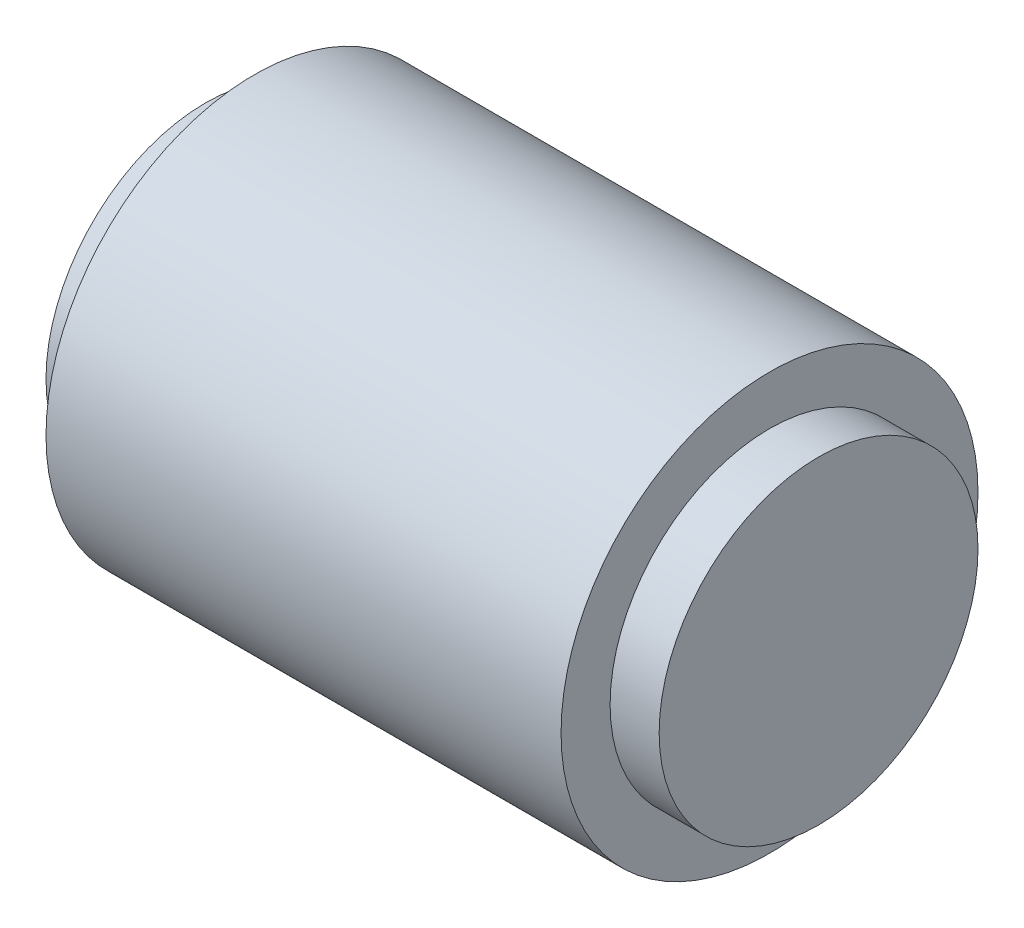
ISO-10303-21;
HEADER;
FILE_DESCRIPTION(('STEP AP214'),'2;1');
FILE_NAME('part.step','',(''),(''),'','','');
FILE_SCHEMA(('AUTOMOTIVE_DESIGN { 1 0 10303 214 1 1 1 1 }'));
ENDSEC;
DATA;
#1=APPLICATION_CONTEXT('core data for automotive mechanical design processes');
#2=APPLICATION_PROTOCOL_DEFINITION('international standard','automotive_design',2000,#1);
#3=PRODUCT_CONTEXT('',#1,'mechanical');
#4=PRODUCT('Part','Part','',(#3));
#5=PRODUCT_RELATED_PRODUCT_CATEGORY('part','',(#4));
#6=PRODUCT_DEFINITION_FORMATION('','',#4);
#7=PRODUCT_DEFINITION_CONTEXT('part definition',#1,'design');
#8=PRODUCT_DEFINITION('design','',#6,#7);
#9=PRODUCT_DEFINITION_SHAPE('','',#8);
#10=(LENGTH_UNIT() NAMED_UNIT(*) SI_UNIT(.MILLI.,.METRE.));
#11=(NAMED_UNIT(*) PLANE_ANGLE_UNIT() SI_UNIT($,.RADIAN.));
#12=(NAMED_UNIT(*) SI_UNIT($,.STERADIAN.) SOLID_ANGLE_UNIT());
#13=UNCERTAINTY_MEASURE_WITH_UNIT(LENGTH_MEASURE(1.E-05),#10,'distance_accuracy_value','');
#14=(GEOMETRIC_REPRESENTATION_CONTEXT(3) GLOBAL_UNCERTAINTY_ASSIGNED_CONTEXT((#13)) GLOBAL_UNIT_ASSIGNED_CONTEXT((#10,
#11,#12)) REPRESENTATION_CONTEXT('',''));
#15=CARTESIAN_POINT('',(0.,0.,0.));
#16=DIRECTION('',(0.,0.,1.));
#17=DIRECTION('',(1.,0.,0.));
#18=AXIS2_PLACEMENT_3D('',#15,#16,#17);
#19=CARTESIAN_POINT('',(-25.,-6.5,0.));
#20=DIRECTION('',(1.,0.,0.));
#21=DIRECTION('',(0.,0.,-1.));
#22=AXIS2_PLACEMENT_3D('',#19,#20,#21);
#23=PLANE('',#22);
#24=CARTESIAN_POINT('',(-25.,0.,0.));
#25=DIRECTION('',(1.,0.,0.));
#26=DIRECTION('',(0.,0.,-1.));
#27=AXIS2_PLACEMENT_3D('',#24,#25,#26);
#28=CIRCLE('',#27,6.5);
#29=CARTESIAN_POINT('',(-25.,0.,-6.5));
#30=VERTEX_POINT('',#29);
#31=EDGE_CURVE('E51',#30,#30,#28,.T.);
#32=ORIENTED_EDGE('',*,*,#31,.F.);
#33=EDGE_LOOP('',(#32));
#34=FACE_BOUND('',#33,.T.);
#35=ADVANCED_FACE('F29',(#34),#23,.F.);
#36=CARTESIAN_POINT('',(0.,0.,0.));
#37=DIRECTION('',(-1.,0.,0.));
#38=DIRECTION('',(0.,0.,1.));
#39=AXIS2_PLACEMENT_3D('',#36,#37,#38);
#40=PLANE('',#39);
#41=CARTESIAN_POINT('',(0.,0.,0.));
#42=DIRECTION('',(1.,0.,0.));
#43=DIRECTION('',(0.,0.,-1.));
#44=AXIS2_PLACEMENT_3D('',#41,#42,#43);
#45=CIRCLE('',#44,6.5);
#46=CARTESIAN_POINT('',(0.,0.,-6.5));
#47=VERTEX_POINT('',#46);
#48=EDGE_CURVE('E10',#47,#47,#45,.T.);
#49=ORIENTED_EDGE('',*,*,#48,.T.);
#50=EDGE_LOOP('',(#49));
#51=FACE_BOUND('',#50,.T.);
#52=ADVANCED_FACE('F77',(#51),#40,.F.);
#53=CARTESIAN_POINT('',(35.0660184255884,0.,0.));
#54=DIRECTION('',(1.,0.,0.));
#55=DIRECTION('',(0.,0.,-1.));
#56=AXIS2_PLACEMENT_3D('',#53,#54,#55);
#57=CYLINDRICAL_SURFACE('',#56,6.5);
#58=ORIENTED_EDGE('',*,*,#48,.F.);
#59=EDGE_LOOP('',(#58));
#60=FACE_BOUND('',#59,.T.);
#61=CARTESIAN_POINT('',(-2.,0.,0.));
#62=DIRECTION('',(1.,0.,0.));
#63=DIRECTION('',(0.,0.,-1.));
#64=AXIS2_PLACEMENT_3D('',#61,#62,#63);
#65=CIRCLE('',#64,6.5);
#66=CARTESIAN_POINT('',(-2.,0.,-6.5));
#67=VERTEX_POINT('',#66);
#68=EDGE_CURVE('E35',#67,#67,#65,.T.);
#69=ORIENTED_EDGE('',*,*,#68,.T.);
#70=EDGE_LOOP('',(#69));
#71=FACE_BOUND('',#70,.T.);
#72=ADVANCED_FACE('F82',(#60,#71),#57,.T.);
#73=CARTESIAN_POINT('',(-2.,-8.5,0.));
#74=DIRECTION('',(-1.,0.,0.));
#75=DIRECTION('',(0.,0.,1.));
#76=AXIS2_PLACEMENT_3D('',#73,#74,#75);
#77=PLANE('',#76);
#78=ORIENTED_EDGE('',*,*,#68,.F.);
#79=EDGE_LOOP('',(#78));
#80=FACE_BOUND('',#79,.T.);
#81=CARTESIAN_POINT('',(-2.,0.,0.));
#82=DIRECTION('',(1.,0.,0.));
#83=DIRECTION('',(0.,0.,-1.));
#84=AXIS2_PLACEMENT_3D('',#81,#82,#83);
#85=CIRCLE('',#84,8.5);
#86=CARTESIAN_POINT('',(-2.,0.,-8.5));
#87=VERTEX_POINT('',#86);
#88=EDGE_CURVE('E39',#87,#87,#85,.T.);
#89=ORIENTED_EDGE('',*,*,#88,.T.);
#90=EDGE_LOOP('',(#89));
#91=FACE_BOUND('',#90,.T.);
#92=ADVANCED_FACE('F98',(#80,#91),#77,.F.);
#93=CARTESIAN_POINT('',(35.0660184255884,0.,0.));
#94=DIRECTION('',(1.,0.,0.));
#95=DIRECTION('',(0.,0.,-1.));
#96=AXIS2_PLACEMENT_3D('',#93,#94,#95);
#97=CYLINDRICAL_SURFACE('',#96,8.5);
#98=CARTESIAN_POINT('',(-12.5,-7.08237248385031,4.7));
#99=CARTESIAN_POINT('',(-12.6203652056581,-7.08237051905884,4.70000142729945));
#100=CARTESIAN_POINT('',(-12.7407147300836,-7.08545083349817,4.69537075402284));
#101=CARTESIAN_POINT('',(-12.9804405392915,-7.09763997691406,4.6769253935247));
#102=CARTESIAN_POINT('',(-13.0998165021281,-7.10675072428559,4.66310778375833));
#103=CARTESIAN_POINT('',(-13.3367423413059,-7.13065428121709,4.62647233079428));
#104=CARTESIAN_POINT('',(-13.4542899085217,-7.14545375102183,4.60364393710211));
#105=CARTESIAN_POINT('',(-13.6866095351931,-7.18016841379333,4.54930911593437));
#106=CARTESIAN_POINT('',(-13.8013803249174,-7.20008590043597,4.51779879713325));
#107=CARTESIAN_POINT('',(-14.1388944914645,-7.26619921357827,4.41127440349213));
#108=CARTESIAN_POINT('',(-14.3566103700019,-7.31895179813542,4.32398547473472));
#109=CARTESIAN_POINT('',(-14.7741004748103,-7.43580241848109,4.11978311383889));
#110=CARTESIAN_POINT('',(-14.9738708170479,-7.4999029014708,4.00286328937593));
#111=CARTESIAN_POINT('',(-15.372414171304,-7.64019073190916,3.72874640899572));
#112=CARTESIAN_POINT('',(-15.5689969484275,-7.71694379531933,3.56865354851087));
#113=CARTESIAN_POINT('',(-15.9343512794768,-7.86938156309791,3.21857429343691));
#114=CARTESIAN_POINT('',(-16.1031059784344,-7.94506559478632,3.02856991715199));
#115=CARTESIAN_POINT('',(-16.3391242662258,-8.05565115267153,2.71482706672974));
#116=CARTESIAN_POINT('',(-16.4175871043808,-8.09341717518475,2.60036072933467));
#117=CARTESIAN_POINT('',(-16.5644846726843,-8.16553327867828,2.36416645474233));
#118=CARTESIAN_POINT('',(-16.6329234867722,-8.19988474895569,2.24244150341633));
#119=CARTESIAN_POINT('',(-16.7590593729932,-8.26417842862639,1.99248750312117));
#120=CARTESIAN_POINT('',(-16.8167601780261,-8.294122169538,1.86426073420593));
#121=CARTESIAN_POINT('',(-16.9207380130007,-8.3487103609807,1.60216759540605));
#122=CARTESIAN_POINT('',(-16.9670165824873,-8.37335552562205,1.46830198840211));
#123=CARTESIAN_POINT('',(-17.0441150544945,-8.41474993392174,1.20744981846162));
#124=CARTESIAN_POINT('',(-17.0759056640061,-8.43198791326759,1.08082737855372));
#125=CARTESIAN_POINT('',(-17.1289143047256,-8.46087184040931,0.824766844936431));
#126=CARTESIAN_POINT('',(-17.150133638184,-8.47251847698309,0.695329100089084));
#127=CARTESIAN_POINT('',(-17.1816813293856,-8.48987435546401,0.434816652119595));
#128=CARTESIAN_POINT('',(-17.1920163055212,-8.4955872054676,0.303742992863567));
#129=CARTESIAN_POINT('',(-17.2016572701205,-8.50091547143297,0.0410710945756316));
#130=CARTESIAN_POINT('',(-17.200964145099,-8.50053137750915,-0.0905271014401542));
#131=CARTESIAN_POINT('',(-17.1892231522629,-8.49404471128307,-0.339095726672583));
#132=CARTESIAN_POINT('',(-17.1792819983652,-8.48855334416514,-0.456136387591878));
#133=CARTESIAN_POINT('',(-17.1507213597211,-8.47284290325187,-0.688869000889557));
#134=CARTESIAN_POINT('',(-17.1320991906107,-8.46262236709889,-0.804560524734044));
#135=CARTESIAN_POINT('',(-17.0863981199442,-8.43769398106224,-1.03372871833718));
#136=CARTESIAN_POINT('',(-17.0593220616304,-8.42298763989891,-1.14720611914441));
#137=CARTESIAN_POINT('',(-16.9970126947121,-8.38942441861402,-1.37128565126162));
#138=CARTESIAN_POINT('',(-16.9617762396006,-8.37056593763826,-1.48188665513892));
#139=CARTESIAN_POINT('',(-16.843532990608,-8.3079310758471,-1.81057955284725));
#140=CARTESIAN_POINT('',(-16.7484359683463,-8.25834503355037,-2.02336292477915));
#141=CARTESIAN_POINT('',(-16.5295724266934,-8.14791666749397,-2.43023978616624));
#142=CARTESIAN_POINT('',(-16.4057968231951,-8.08707077834442,-2.62432732597161));
#143=CARTESIAN_POINT('',(-16.1177384150641,-7.95173868927888,-3.01100968754378));
#144=CARTESIAN_POINT('',(-15.9505164581314,-7.87648876950413,-3.20115374062658));
#145=CARTESIAN_POINT('',(-15.5880721788849,-7.724573412885,-3.55213130903994));
#146=CARTESIAN_POINT('',(-15.392820632895,-7.64790657236262,-3.71293383044693));
#147=CARTESIAN_POINT('',(-14.9586090171485,-7.49400640421319,-4.01511119853954));
#148=CARTESIAN_POINT('',(-14.717302450268,-7.41733439981516,-4.15346688615357));
#149=CARTESIAN_POINT('',(-14.3371222927061,-7.31574124687166,-4.32833629963319));
#150=CARTESIAN_POINT('',(-14.2073342263191,-7.2841082527669,-4.38118855784614));
#151=CARTESIAN_POINT('',(-13.9424447003849,-7.22661561780152,-4.47538486325711));
#152=CARTESIAN_POINT('',(-13.807346932917,-7.20075204590165,-4.51673675108816));
#153=CARTESIAN_POINT('',(-13.5438771672071,-7.15780422222049,-4.58446495282761));
#154=CARTESIAN_POINT('',(-13.4158322628942,-7.14018298665204,-4.6117749578275));
#155=CARTESIAN_POINT('',(-13.1572396080735,-7.11164339143349,-4.65566508265739));
#156=CARTESIAN_POINT('',(-13.0266933676671,-7.1007211113006,-4.67225147865837));
#157=CARTESIAN_POINT('',(-12.7643615587469,-7.08609558182642,-4.69440385355912));
#158=CARTESIAN_POINT('',(-12.6325769889938,-7.08238694527754,-4.69997805650284));
#159=CARTESIAN_POINT('',(-12.3690143653643,-7.08235811253355,-4.70002180883153));
#160=CARTESIAN_POINT('',(-12.2372363124106,-7.08603708908178,-4.69449260156397));
#161=CARTESIAN_POINT('',(-11.9944473690131,-7.09951674664522,-4.67407551403972));
#162=CARTESIAN_POINT('',(-11.8832510880993,-7.1083301661064,-4.66069484316186));
#163=CARTESIAN_POINT('',(-11.6625685100581,-7.13086365346316,-4.62614312079132));
#164=CARTESIAN_POINT('',(-11.5530827419814,-7.14458520924081,-4.60496970690311));
#165=CARTESIAN_POINT('',(-11.228246063643,-7.19247174470709,-4.53011334851335));
#166=CARTESIAN_POINT('',(-11.0163866128301,-7.23336657702825,-4.46508306841364));
#167=CARTESIAN_POINT('',(-10.598080396117,-7.33034680931937,-4.30408223438218));
#168=CARTESIAN_POINT('',(-10.392227391165,-7.38699436655751,-4.20693493663956));
#169=CARTESIAN_POINT('',(-9.99847598339761,-7.50883106773685,-3.98540200888254));
#170=CARTESIAN_POINT('',(-9.81058646807662,-7.57402440229604,-3.86100299514427));
#171=CARTESIAN_POINT('',(-9.426542977742,-7.71812920360414,-3.56534406921645));
#172=CARTESIAN_POINT('',(-9.23390146666726,-7.79756319616587,-3.38976768850456));
#173=CARTESIAN_POINT('',(-8.87931739827047,-7.95260360908088,-3.0080636231188));
#174=CARTESIAN_POINT('',(-8.71739335303637,-8.02820770133119,-2.80191764795081));
#175=CARTESIAN_POINT('',(-8.49715002440686,-8.1350127782603,-2.46705211863367));
#176=CARTESIAN_POINT('',(-8.42606265961709,-8.17029620842058,-2.34785409487927));
#177=CARTESIAN_POINT('',(-8.29432218442582,-8.23677626473988,-2.10276079413955));
#178=CARTESIAN_POINT('',(-8.23366440832777,-8.2679747168242,-1.97686854500202));
#179=CARTESIAN_POINT('',(-8.12350793355991,-8.32535134968058,-1.71928216724073));
#180=CARTESIAN_POINT('',(-8.07400260478432,-8.35153251183072,-1.58759154170824));
#181=CARTESIAN_POINT('',(-7.986780611343,-8.39808231090582,-1.319366196905));
#182=CARTESIAN_POINT('',(-7.94906217482334,-8.41845182142196,-1.18283220914767));
#183=CARTESIAN_POINT('',(-7.88922318855488,-8.45095857442492,-0.920307023805964));
#184=CARTESIAN_POINT('',(-7.86590158939351,-8.46372486697502,-0.794666431384168));
#185=CARTESIAN_POINT('',(-7.82954402145036,-8.48368591996237,-0.54147264082718));
#186=CARTESIAN_POINT('',(-7.81650694066117,-8.49088128275153,-0.41391965098895));
#187=CARTESIAN_POINT('',(-7.80090984875112,-8.49949445489548,-0.158035154984153));
#188=CARTESIAN_POINT('',(-7.79834531716869,-8.50091475704617,-0.0297040086694109));
#189=CARTESIAN_POINT('',(-7.80371840878135,-8.49794421086991,0.226665398056366));
#190=CARTESIAN_POINT('',(-7.81165548994734,-8.49355366246355,0.354703673241946));
#191=CARTESIAN_POINT('',(-7.83671704313967,-8.47974699518894,0.597766955800252));
#192=CARTESIAN_POINT('',(-7.85293797696484,-8.47082552483959,0.712914180242321));
#193=CARTESIAN_POINT('',(-7.89375818143125,-8.44850164825868,0.941282914340208));
#194=CARTESIAN_POINT('',(-7.9183600595594,-8.43509784750433,1.05450381315169));
#195=CARTESIAN_POINT('',(-8.00435236234511,-8.3885909174889,1.39009216811059));
#196=CARTESIAN_POINT('',(-8.07795176987398,-8.34917948220641,1.60859649118793));
#197=CARTESIAN_POINT('',(-8.25778206451449,-8.25532301844568,2.03702528711361));
#198=CARTESIAN_POINT('',(-8.36502318932531,-8.20041873721584,2.24641738664634));
#199=CARTESIAN_POINT('',(-8.60786150598724,-8.08069240841173,2.64494437630369));
#200=CARTESIAN_POINT('',(-8.74347001300394,-8.01586640604412,2.83407113734074));
#201=CARTESIAN_POINT('',(-9.05713104507521,-7.87347281361376,3.20988321406011));
#202=CARTESIAN_POINT('',(-9.23827964518915,-7.79529894221302,3.39375170232005));
#203=CARTESIAN_POINT('',(-9.62881741441192,-7.64013103503081,3.72997635790216));
#204=CARTESIAN_POINT('',(-9.8382410259081,-7.56313856775613,3.88229350926577));
#205=CARTESIAN_POINT('',(-10.1783097119365,-7.45236205841788,4.08888790752881));
#206=CARTESIAN_POINT('',(-10.300306547947,-7.41513321658793,4.15581982219406));
#207=CARTESIAN_POINT('',(-10.5506881367075,-7.34475313447282,4.27897447961229));
#208=CARTESIAN_POINT('',(-10.679069624761,-7.31159983972413,4.33520262598967));
#209=CARTESIAN_POINT('',(-10.9411639774333,-7.25077705325597,4.43618148409558));
#210=CARTESIAN_POINT('',(-11.0748632868476,-7.22309457308961,4.48095945627514));
#211=CARTESIAN_POINT('',(-11.3468078665459,-7.17439755700028,4.55852174434141));
#212=CARTESIAN_POINT('',(-11.4850501984345,-7.15337880119001,4.59131365257427));
#213=CARTESIAN_POINT('',(-11.7684134940513,-7.11863498203375,4.64500723854832));
#214=CARTESIAN_POINT('',(-11.9136200092697,-7.10510712536878,4.66558836446547));
#215=CARTESIAN_POINT('',(-12.2058921972318,-7.08697724420066,4.69308361644808));
#216=CARTESIAN_POINT('',(-12.352957799866,-7.08237488410591,4.69999825636279));
#217=CARTESIAN_POINT('',(-12.5,-7.08237248385031,4.7));
#218=B_SPLINE_CURVE_WITH_KNOTS('',3,(#98,#99,#100,#101,#102,#103,#104,#105,#106,#107,#108,#109,
#110,#111,#112,#113,#114,#115,#116,#117,#118,#119,#120,#121,#122,#123,#124,#125,#126,#127,#128,
#129,#130,#131,#132,#133,#134,#135,#136,#137,#138,#139,#140,#141,#142,#143,#144,#145,#146,#147,
#148,#149,#150,#151,#152,#153,#154,#155,#156,#157,#158,#159,#160,#161,#162,#163,#164,#165,#166,
#167,#168,#169,#170,#171,#172,#173,#174,#175,#176,#177,#178,#179,#180,#181,#182,#183,#184,#185,
#186,#187,#188,#189,#190,#191,#192,#193,#194,#195,#196,#197,#198,#199,#200,#201,#202,#203,#204,
#205,#206,#207,#208,#209,#210,#211,#212,#213,#214,#215,#216,#217),.UNSPECIFIED.,.T.,.F.,(4,2,2,
2,2,2,2,2,2,2,2,2,2,2,2,2,2,2,2,2,2,2,2,2,2,2,2,2,2,2,2,2,2,2,2,2,2,2,2,2,2,2,2,2,2,2,2,2,2,2,2,
2,2,2,2,2,2,2,2,4),(0.,0.360941044243249,0.721996965891923,1.0834768986428,1.44511911461457,
2.16306157721852,2.88115905483606,3.67267593311717,4.46467047200002,4.89565883599235,
5.32647111741846,5.75713335281746,6.18773750971302,6.58224254596111,6.97669897204052,
7.37091540440134,7.76510014708731,8.11745163959396,8.46991215941225,8.82225426590069,
9.17473245623266,9.88637985349748,10.5982529781237,11.3874289809538,12.1774338370685,
13.038018112231,13.4684629220844,13.8986135431646,14.2943368155011,14.6898282740327,
15.0850242627596,15.480176000349,15.8168088404148,16.1535438159979,16.826628792939,
17.5277712554681,18.229258834569,19.0433193842061,19.8578689851155,20.2869746225429,
20.7158877964579,21.1445453055374,21.5731383460328,21.9578797932868,22.342579634897,
22.7271134037818,23.111627326157,23.4610868857488,23.810655268959,24.5091614850146,
25.2310595919841,25.9532462002197,26.7590305633882,27.5658054773833,27.9974464879388,
28.4288690102472,28.8592546371519,29.2893671700116,29.730321519001,30.1712592881347),.UNSPECIFIED.);
#219=CARTESIAN_POINT('',(-12.5,-7.08237248385031,4.7));
#220=VERTEX_POINT('',#219);
#221=EDGE_CURVE('E54',#220,#220,#218,.T.);
#222=ORIENTED_EDGE('',*,*,#221,.F.);
#223=EDGE_LOOP('',(#222));
#224=FACE_BOUND('',#223,.T.);
#225=ORIENTED_EDGE('',*,*,#88,.F.);
#226=EDGE_LOOP('',(#225));
#227=FACE_BOUND('',#226,.T.);
#228=CARTESIAN_POINT('',(-23.,0.,0.));
#229=DIRECTION('',(1.,0.,0.));
#230=DIRECTION('',(0.,0.,-1.));
#231=AXIS2_PLACEMENT_3D('',#228,#229,#230);
#232=CIRCLE('',#231,8.5);
#233=CARTESIAN_POINT('',(-23.,0.,-8.5));
#234=VERTEX_POINT('',#233);
#235=EDGE_CURVE('E43',#234,#234,#232,.T.);
#236=ORIENTED_EDGE('',*,*,#235,.T.);
#237=EDGE_LOOP('',(#236));
#238=FACE_BOUND('',#237,.T.);
#239=ADVANCED_FACE('F91',(#224,#227,#238),#97,.T.);
#240=CARTESIAN_POINT('',(-23.,-8.5,0.));
#241=DIRECTION('',(1.,0.,0.));
#242=DIRECTION('',(0.,0.,-1.));
#243=AXIS2_PLACEMENT_3D('',#240,#241,#242);
#244=PLANE('',#243);
#245=ORIENTED_EDGE('',*,*,#235,.F.);
#246=EDGE_LOOP('',(#245));
#247=FACE_BOUND('',#246,.T.);
#248=CARTESIAN_POINT('',(-23.,0.,0.));
#249=DIRECTION('',(1.,0.,0.));
#250=DIRECTION('',(0.,0.,-1.));
#251=AXIS2_PLACEMENT_3D('',#248,#249,#250);
#252=CIRCLE('',#251,6.5);
#253=CARTESIAN_POINT('',(-23.,0.,-6.5));
#254=VERTEX_POINT('',#253);
#255=EDGE_CURVE('E48',#254,#254,#252,.T.);
#256=ORIENTED_EDGE('',*,*,#255,.T.);
#257=EDGE_LOOP('',(#256));
#258=FACE_BOUND('',#257,.T.);
#259=ADVANCED_FACE('F86',(#247,#258),#244,.F.);
#260=CARTESIAN_POINT('',(35.0660184255884,0.,0.));
#261=DIRECTION('',(1.,0.,0.));
#262=DIRECTION('',(0.,0.,-1.));
#263=AXIS2_PLACEMENT_3D('',#260,#261,#262);
#264=CYLINDRICAL_SURFACE('',#263,6.5);
#265=ORIENTED_EDGE('',*,*,#255,.F.);
#266=EDGE_LOOP('',(#265));
#267=FACE_BOUND('',#266,.T.);
#268=ORIENTED_EDGE('',*,*,#31,.T.);
#269=EDGE_LOOP('',(#268));
#270=FACE_BOUND('',#269,.T.);
#271=ADVANCED_FACE('F73',(#267,#270),#264,.T.);
#272=CARTESIAN_POINT('',(-12.5,-8.501,0.));
#273=DIRECTION('',(0.,1.,0.));
#274=DIRECTION('',(0.,0.,1.));
#275=AXIS2_PLACEMENT_3D('',#272,#273,#274);
#276=CYLINDRICAL_SURFACE('',#275,4.7);
#277=CARTESIAN_POINT('',(-12.5,0.,0.));
#278=DIRECTION('',(0.,1.,0.));
#279=DIRECTION('',(0.,0.,1.));
#280=AXIS2_PLACEMENT_3D('',#277,#278,#279);
#281=CIRCLE('',#280,4.7);
#282=CARTESIAN_POINT('',(-12.5,0.,4.7));
#283=VERTEX_POINT('',#282);
#284=EDGE_CURVE('E61',#283,#283,#281,.T.);
#285=ORIENTED_EDGE('',*,*,#284,.T.);
#286=EDGE_LOOP('',(#285));
#287=FACE_BOUND('',#286,.T.);
#288=ORIENTED_EDGE('',*,*,#221,.T.);
#289=EDGE_LOOP('',(#288));
#290=FACE_BOUND('',#289,.T.);
#291=ADVANCED_FACE('F62',(#287,#290),#276,.F.);
#292=CARTESIAN_POINT('',(-12.5,0.,0.));
#293=DIRECTION('',(0.,1.,0.));
#294=DIRECTION('',(0.,0.,1.));
#295=AXIS2_PLACEMENT_3D('',#292,#293,#294);
#296=PLANE('',#295);
#297=ORIENTED_EDGE('',*,*,#284,.F.);
#298=EDGE_LOOP('',(#297));
#299=FACE_BOUND('',#298,.T.);
#300=ADVANCED_FACE('F67',(#299),#296,.F.);
#301=CLOSED_SHELL('',(#35,#52,#72,#92,#239,#259,#271,#291,#300));
#302=MANIFOLD_SOLID_BREP('B2',#301);
#303=ADVANCED_BREP_SHAPE_REPRESENTATION('',(#18,#302),#14);
#304=SHAPE_DEFINITION_REPRESENTATION(#9,#303);
ENDSEC;
END-ISO-10303-21;
